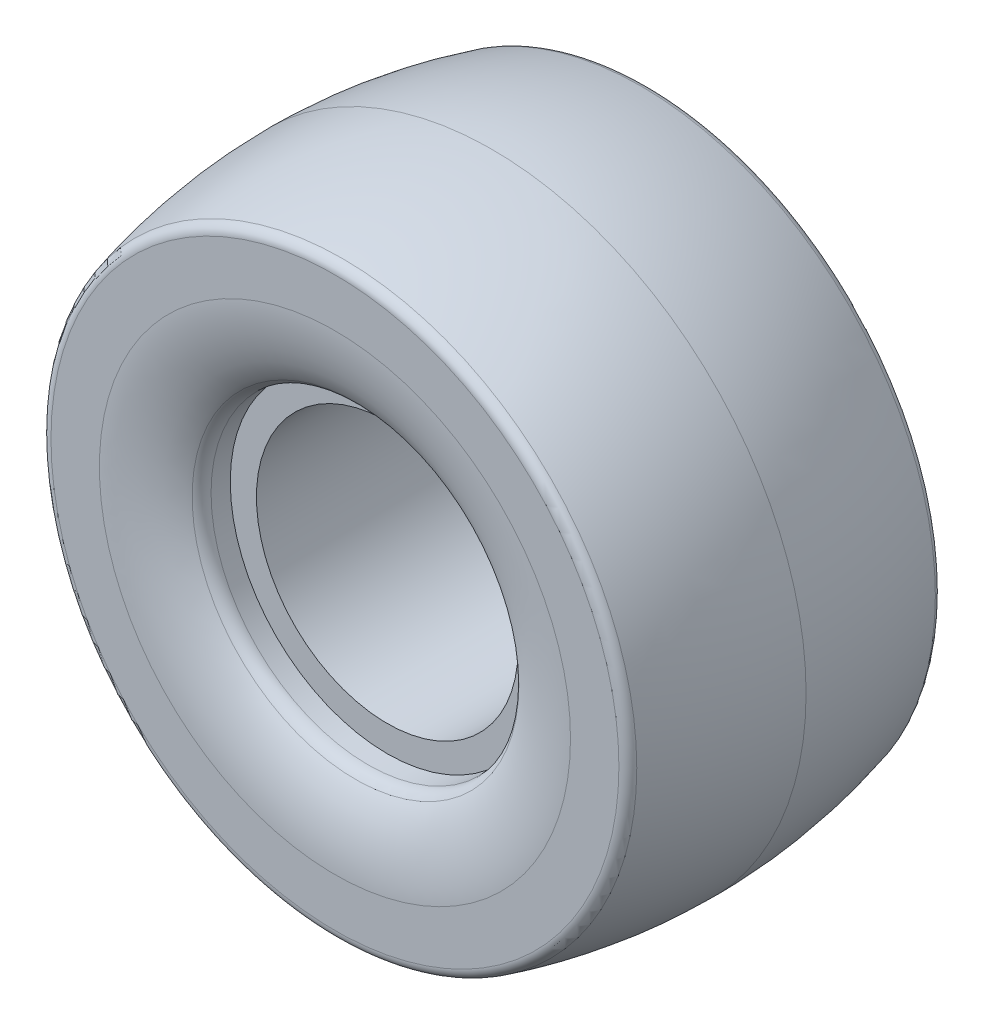
ISO-10303-21;
HEADER;
FILE_DESCRIPTION(('STEP AP214'),'2;1');
FILE_NAME('part.step','',(''),(''),'','','');
FILE_SCHEMA(('AUTOMOTIVE_DESIGN { 1 0 10303 214 1 1 1 1 }'));
ENDSEC;
DATA;
#1=APPLICATION_CONTEXT('core data for automotive mechanical design processes');
#2=APPLICATION_PROTOCOL_DEFINITION('international standard','automotive_design',2000,#1);
#3=PRODUCT_CONTEXT('',#1,'mechanical');
#4=PRODUCT('Part','Part','',(#3));
#5=PRODUCT_RELATED_PRODUCT_CATEGORY('part','',(#4));
#6=PRODUCT_DEFINITION_FORMATION('','',#4);
#7=PRODUCT_DEFINITION_CONTEXT('part definition',#1,'design');
#8=PRODUCT_DEFINITION('design','',#6,#7);
#9=PRODUCT_DEFINITION_SHAPE('','',#8);
#10=(LENGTH_UNIT() NAMED_UNIT(*) SI_UNIT(.MILLI.,.METRE.));
#11=(NAMED_UNIT(*) PLANE_ANGLE_UNIT() SI_UNIT($,.RADIAN.));
#12=(NAMED_UNIT(*) SI_UNIT($,.STERADIAN.) SOLID_ANGLE_UNIT());
#13=UNCERTAINTY_MEASURE_WITH_UNIT(LENGTH_MEASURE(1.E-05),#10,'distance_accuracy_value','');
#14=(GEOMETRIC_REPRESENTATION_CONTEXT(3) GLOBAL_UNCERTAINTY_ASSIGNED_CONTEXT((#13)) GLOBAL_UNIT_ASSIGNED_CONTEXT((#10,
#11,#12)) REPRESENTATION_CONTEXT('',''));
#15=CARTESIAN_POINT('',(0.,0.,0.));
#16=DIRECTION('',(0.,0.,1.));
#17=DIRECTION('',(1.,0.,0.));
#18=AXIS2_PLACEMENT_3D('',#15,#16,#17);
#19=CARTESIAN_POINT('',(0.,25.,20.));
#20=DIRECTION('',(0.,0.,-1.));
#21=DIRECTION('',(-1.,0.,0.));
#22=AXIS2_PLACEMENT_3D('',#19,#20,#21);
#23=PLANE('',#22);
#24=CARTESIAN_POINT('',(0.,0.,20.));
#25=DIRECTION('',(0.,0.,1.));
#26=DIRECTION('',(1.,0.,0.));
#27=AXIS2_PLACEMENT_3D('',#24,#25,#26);
#28=CIRCLE('',#27,25.);
#29=CARTESIAN_POINT('',(25.,0.,20.));
#30=VERTEX_POINT('',#29);
#31=EDGE_CURVE('E81',#30,#30,#28,.T.);
#32=ORIENTED_EDGE('',*,*,#31,.F.);
#33=EDGE_LOOP('',(#32));
#34=FACE_BOUND('',#33,.T.);
#35=CARTESIAN_POINT('',(0.,0.,20.));
#36=DIRECTION('',(0.,0.,1.));
#37=DIRECTION('',(1.,0.,0.));
#38=AXIS2_PLACEMENT_3D('',#35,#36,#37);
#39=CIRCLE('',#38,30.);
#40=CARTESIAN_POINT('',(30.,0.,20.));
#41=VERTEX_POINT('',#40);
#42=EDGE_CURVE('E10',#41,#41,#39,.T.);
#43=ORIENTED_EDGE('',*,*,#42,.T.);
#44=EDGE_LOOP('',(#43));
#45=FACE_BOUND('',#44,.T.);
#46=ADVANCED_FACE('F32',(#34,#45),#23,.F.);
#47=CARTESIAN_POINT('',(0.,0.,30.));
#48=DIRECTION('',(0.,0.,1.));
#49=DIRECTION('',(1.,0.,0.));
#50=AXIS2_PLACEMENT_3D('',#47,#48,#49);
#51=CYLINDRICAL_SURFACE('',#50,30.);
#52=ORIENTED_EDGE('',*,*,#42,.F.);
#53=EDGE_LOOP('',(#52));
#54=FACE_BOUND('',#53,.T.);
#55=CARTESIAN_POINT('',(0.,0.,23.668508033315));
#56=DIRECTION('',(0.,0.,1.));
#57=DIRECTION('',(1.,0.,0.));
#58=AXIS2_PLACEMENT_3D('',#55,#56,#57);
#59=CIRCLE('',#58,30.);
#60=CARTESIAN_POINT('',(30.,0.,23.668508033315));
#61=VERTEX_POINT('',#60);
#62=EDGE_CURVE('E38',#61,#61,#59,.T.);
#63=ORIENTED_EDGE('',*,*,#62,.T.);
#64=EDGE_LOOP('',(#63));
#65=FACE_BOUND('',#64,.T.);
#66=ADVANCED_FACE('F105',(#54,#65),#51,.F.);
#67=CARTESIAN_POINT('',(0.,0.,23.668508033315));
#68=DIRECTION('',(0.,0.,1.));
#69=DIRECTION('',(1.,0.,0.));
#70=AXIS2_PLACEMENT_3D('',#67,#68,#69);
#71=TOROIDAL_SURFACE('',#70,33.,3.00000000000001);
#72=ORIENTED_EDGE('',*,*,#62,.F.);
#73=EDGE_LOOP('',(#72));
#74=FACE_BOUND('',#73,.T.);
#75=CARTESIAN_POINT('',(0.,0.,26.074101645712));
#76=DIRECTION('',(0.,0.,1.));
#77=DIRECTION('',(1.,0.,0.));
#78=AXIS2_PLACEMENT_3D('',#75,#76,#77);
#79=CIRCLE('',#78,31.2074823928355);
#80=CARTESIAN_POINT('',(31.2074823928355,0.,26.074101645712));
#81=VERTEX_POINT('',#80);
#82=EDGE_CURVE('E42',#81,#81,#79,.T.);
#83=ORIENTED_EDGE('',*,*,#82,.T.);
#84=EDGE_LOOP('',(#83));
#85=FACE_BOUND('',#84,.T.);
#86=ADVANCED_FACE('F101',(#74,#85),#71,.T.);
#87=CARTESIAN_POINT('',(0.,45.,30.));
#88=CARTESIAN_POINT('',(0.,42.6861559304344,30.));
#89=CARTESIAN_POINT('',(0.,37.4315997394432,29.2603583772244));
#90=CARTESIAN_POINT('',(0.,32.8491850054114,27.297409200074));
#91=CARTESIAN_POINT('',(0.,31.2074823928355,26.074101645712));
#92=B_SPLINE_CURVE_WITH_KNOTS('',3,(#87,#88,#89,#90,#91),.UNSPECIFIED.,.F.,.F.,(4,1,4),(0.,
0.439021044618023,0.878042089236046),.UNSPECIFIED.);
#93=CARTESIAN_POINT('',(0.,0.,30.));
#94=DIRECTION('',(0.,0.,1.));
#95=AXIS1_PLACEMENT('',#93,#94);
#96=SURFACE_OF_REVOLUTION('',#92,#95);
#97=ORIENTED_EDGE('',*,*,#82,.F.);
#98=EDGE_LOOP('',(#97));
#99=FACE_BOUND('',#98,.T.);
#100=CARTESIAN_POINT('',(0.,0.,30.));
#101=DIRECTION('',(0.,0.,1.));
#102=DIRECTION('',(1.,0.,0.));
#103=AXIS2_PLACEMENT_3D('',#100,#101,#102);
#104=CIRCLE('',#103,45.);
#105=CARTESIAN_POINT('',(45.,0.,30.));
#106=VERTEX_POINT('',#105);
#107=EDGE_CURVE('E46',#106,#106,#104,.T.);
#108=ORIENTED_EDGE('',*,*,#107,.T.);
#109=EDGE_LOOP('',(#108));
#110=FACE_BOUND('',#109,.T.);
#111=ADVANCED_FACE('F96',(#99,#110),#96,.T.);
#112=CARTESIAN_POINT('',(0.,54.2456211986775,30.));
#113=DIRECTION('',(0.,0.,-1.));
#114=DIRECTION('',(-1.,0.,0.));
#115=AXIS2_PLACEMENT_3D('',#112,#113,#114);
#116=PLANE('',#115);
#117=ORIENTED_EDGE('',*,*,#107,.F.);
#118=EDGE_LOOP('',(#117));
#119=FACE_BOUND('',#118,.T.);
#120=CARTESIAN_POINT('',(0.,0.,30.));
#121=DIRECTION('',(0.,0.,1.));
#122=DIRECTION('',(1.,0.,0.));
#123=AXIS2_PLACEMENT_3D('',#120,#121,#122);
#124=CIRCLE('',#123,54.2456211986775);
#125=CARTESIAN_POINT('',(54.2456211986775,0.,30.));
#126=VERTEX_POINT('',#125);
#127=EDGE_CURVE('E51',#126,#126,#124,.T.);
#128=ORIENTED_EDGE('',*,*,#127,.T.);
#129=EDGE_LOOP('',(#128));
#130=FACE_BOUND('',#129,.T.);
#131=ADVANCED_FACE('F100',(#119,#130),#116,.F.);
#132=CARTESIAN_POINT('',(0.,0.,28.));
#133=DIRECTION('',(0.,0.,1.));
#134=DIRECTION('',(1.,0.,0.));
#135=AXIS2_PLACEMENT_3D('',#132,#133,#134);
#136=TOROIDAL_SURFACE('',#135,54.2456211986775,2.);
#137=ORIENTED_EDGE('',*,*,#127,.F.);
#138=EDGE_LOOP('',(#137));
#139=FACE_BOUND('',#138,.T.);
#140=CARTESIAN_POINT('',(0.,0.,28.51788086221));
#141=DIRECTION('',(0.,0.,1.));
#142=DIRECTION('',(1.,0.,0.));
#143=AXIS2_PLACEMENT_3D('',#140,#141,#142);
#144=CIRCLE('',#143,56.1774077843428);
#145=CARTESIAN_POINT('',(56.1774077843428,0.,28.51788086221));
#146=VERTEX_POINT('',#145);
#147=EDGE_CURVE('E54',#146,#146,#144,.T.);
#148=ORIENTED_EDGE('',*,*,#147,.T.);
#149=EDGE_LOOP('',(#148));
#150=FACE_BOUND('',#149,.T.);
#151=ADVANCED_FACE('F164',(#139,#150),#136,.T.);
#152=CARTESIAN_POINT('',(0.,60.,0.));
#153=CARTESIAN_POINT('',(0.,59.9999999999986,4.75298014370305));
#154=CARTESIAN_POINT('',(0.,59.3629012973828,14.2589404311289));
#155=CARTESIAN_POINT('',(0.,57.4516051895622,23.764900718499));
#156=CARTESIAN_POINT('',(0.,56.1774077843428,28.51788086221));
#157=B_SPLINE_CURVE_WITH_KNOTS('',3,(#152,#153,#154,#155,#156),.UNSPECIFIED.,.F.,.F.,(4,1,4),
(0.0247019856292679,0.262350992814421,0.499999999999573),.UNSPECIFIED.);
#158=CARTESIAN_POINT('',(0.,0.,30.));
#159=DIRECTION('',(0.,0.,1.));
#160=AXIS1_PLACEMENT('',#158,#159);
#161=SURFACE_OF_REVOLUTION('',#157,#160);
#162=ORIENTED_EDGE('',*,*,#147,.F.);
#163=EDGE_LOOP('',(#162));
#164=FACE_BOUND('',#163,.T.);
#165=CARTESIAN_POINT('',(0.,0.,0.));
#166=DIRECTION('',(0.,0.,1.));
#167=DIRECTION('',(1.,0.,0.));
#168=AXIS2_PLACEMENT_3D('',#165,#166,#167);
#169=CIRCLE('',#168,60.);
#170=CARTESIAN_POINT('',(60.,0.,0.));
#171=VERTEX_POINT('',#170);
#172=EDGE_CURVE('E57',#171,#171,#169,.T.);
#173=ORIENTED_EDGE('',*,*,#172,.T.);
#174=EDGE_LOOP('',(#173));
#175=FACE_BOUND('',#174,.T.);
#176=ADVANCED_FACE('F161',(#164,#175),#161,.T.);
#177=CARTESIAN_POINT('',(0.,56.1774077843429,-28.51788086221));
#178=CARTESIAN_POINT('',(0.,57.4516051895622,-23.764900718499));
#179=CARTESIAN_POINT('',(0.,59.3629012973828,-14.2589404311289));
#180=CARTESIAN_POINT('',(0.,59.9999999999986,-4.75298014370305));
#181=CARTESIAN_POINT('',(0.,60.,0.));
#182=B_SPLINE_CURVE_WITH_KNOTS('',3,(#177,#178,#179,#180,#181),.UNSPECIFIED.,.F.,.F.,(4,1,4),
(0.0247019856292679,0.262350992814421,0.499999999999573),.UNSPECIFIED.);
#183=CARTESIAN_POINT('',(0.,0.,30.));
#184=DIRECTION('',(0.,0.,1.));
#185=AXIS1_PLACEMENT('',#183,#184);
#186=SURFACE_OF_REVOLUTION('',#182,#185);
#187=ORIENTED_EDGE('',*,*,#172,.F.);
#188=EDGE_LOOP('',(#187));
#189=FACE_BOUND('',#188,.T.);
#190=CARTESIAN_POINT('',(0.,0.,-28.51788086221));
#191=DIRECTION('',(0.,0.,1.));
#192=DIRECTION('',(1.,0.,0.));
#193=AXIS2_PLACEMENT_3D('',#190,#191,#192);
#194=CIRCLE('',#193,56.1774077843429);
#195=CARTESIAN_POINT('',(56.1774077843429,0.,-28.51788086221));
#196=VERTEX_POINT('',#195);
#197=EDGE_CURVE('E60',#196,#196,#194,.T.);
#198=ORIENTED_EDGE('',*,*,#197,.T.);
#199=EDGE_LOOP('',(#198));
#200=FACE_BOUND('',#199,.T.);
#201=ADVANCED_FACE('F157',(#189,#200),#186,.T.);
#202=CARTESIAN_POINT('',(0.,0.,-28.));
#203=DIRECTION('',(0.,0.,1.));
#204=DIRECTION('',(1.,0.,0.));
#205=AXIS2_PLACEMENT_3D('',#202,#203,#204);
#206=TOROIDAL_SURFACE('',#205,54.2456211986775,2.);
#207=ORIENTED_EDGE('',*,*,#197,.F.);
#208=EDGE_LOOP('',(#207));
#209=FACE_BOUND('',#208,.T.);
#210=CARTESIAN_POINT('',(0.,0.,-30.));
#211=DIRECTION('',(0.,0.,1.));
#212=DIRECTION('',(1.,0.,0.));
#213=AXIS2_PLACEMENT_3D('',#210,#211,#212);
#214=CIRCLE('',#213,54.2456211986775);
#215=CARTESIAN_POINT('',(54.2456211986775,0.,-30.));
#216=VERTEX_POINT('',#215);
#217=EDGE_CURVE('E63',#216,#216,#214,.T.);
#218=ORIENTED_EDGE('',*,*,#217,.T.);
#219=EDGE_LOOP('',(#218));
#220=FACE_BOUND('',#219,.T.);
#221=ADVANCED_FACE('F160',(#209,#220),#206,.T.);
#222=CARTESIAN_POINT('',(0.,54.2456211986775,-30.));
#223=DIRECTION('',(0.,0.,1.));
#224=DIRECTION('',(1.,0.,0.));
#225=AXIS2_PLACEMENT_3D('',#222,#223,#224);
#226=PLANE('',#225);
#227=ORIENTED_EDGE('',*,*,#217,.F.);
#228=EDGE_LOOP('',(#227));
#229=FACE_BOUND('',#228,.T.);
#230=CARTESIAN_POINT('',(0.,0.,-30.));
#231=DIRECTION('',(0.,0.,1.));
#232=DIRECTION('',(1.,0.,0.));
#233=AXIS2_PLACEMENT_3D('',#230,#231,#232);
#234=CIRCLE('',#233,45.);
#235=CARTESIAN_POINT('',(45.,0.,-30.));
#236=VERTEX_POINT('',#235);
#237=EDGE_CURVE('E66',#236,#236,#234,.T.);
#238=ORIENTED_EDGE('',*,*,#237,.T.);
#239=EDGE_LOOP('',(#238));
#240=FACE_BOUND('',#239,.T.);
#241=ADVANCED_FACE('F141',(#229,#240),#226,.F.);
#242=CARTESIAN_POINT('',(0.,31.2074823928356,-26.074101645712));
#243=CARTESIAN_POINT('',(0.,32.8491850054114,-27.297409200074));
#244=CARTESIAN_POINT('',(0.,37.4315997394432,-29.2603583772244));
#245=CARTESIAN_POINT('',(0.,42.6861559304344,-30.));
#246=CARTESIAN_POINT('',(0.,45.,-30.));
#247=B_SPLINE_CURVE_WITH_KNOTS('',3,(#242,#243,#244,#245,#246),.UNSPECIFIED.,.F.,.F.,(4,1,4),
(0.,0.439021044618023,0.878042089236046),.UNSPECIFIED.);
#248=CARTESIAN_POINT('',(0.,0.,30.));
#249=DIRECTION('',(0.,0.,1.));
#250=AXIS1_PLACEMENT('',#248,#249);
#251=SURFACE_OF_REVOLUTION('',#247,#250);
#252=ORIENTED_EDGE('',*,*,#237,.F.);
#253=EDGE_LOOP('',(#252));
#254=FACE_BOUND('',#253,.T.);
#255=CARTESIAN_POINT('',(0.,0.,-26.0741016457121));
#256=DIRECTION('',(0.,0.,1.));
#257=DIRECTION('',(1.,0.,0.));
#258=AXIS2_PLACEMENT_3D('',#255,#256,#257);
#259=CIRCLE('',#258,31.2074823928355);
#260=CARTESIAN_POINT('',(31.2074823928355,0.,-26.0741016457121));
#261=VERTEX_POINT('',#260);
#262=EDGE_CURVE('E69',#261,#261,#259,.T.);
#263=ORIENTED_EDGE('',*,*,#262,.T.);
#264=EDGE_LOOP('',(#263));
#265=FACE_BOUND('',#264,.T.);
#266=ADVANCED_FACE('F136',(#254,#265),#251,.T.);
#267=CARTESIAN_POINT('',(0.,0.,-23.668508033315));
#268=DIRECTION('',(0.,0.,1.));
#269=DIRECTION('',(1.,0.,0.));
#270=AXIS2_PLACEMENT_3D('',#267,#268,#269);
#271=TOROIDAL_SURFACE('',#270,33.,3.00000000000001);
#272=ORIENTED_EDGE('',*,*,#262,.F.);
#273=EDGE_LOOP('',(#272));
#274=FACE_BOUND('',#273,.T.);
#275=CARTESIAN_POINT('',(0.,0.,-23.668508033315));
#276=DIRECTION('',(0.,0.,1.));
#277=DIRECTION('',(1.,0.,0.));
#278=AXIS2_PLACEMENT_3D('',#275,#276,#277);
#279=CIRCLE('',#278,30.);
#280=CARTESIAN_POINT('',(30.,0.,-23.668508033315));
#281=VERTEX_POINT('',#280);
#282=EDGE_CURVE('E72',#281,#281,#279,.T.);
#283=ORIENTED_EDGE('',*,*,#282,.T.);
#284=EDGE_LOOP('',(#283));
#285=FACE_BOUND('',#284,.T.);
#286=ADVANCED_FACE('F132',(#274,#285),#271,.T.);
#287=CARTESIAN_POINT('',(0.,0.,30.));
#288=DIRECTION('',(0.,0.,1.));
#289=DIRECTION('',(1.,0.,0.));
#290=AXIS2_PLACEMENT_3D('',#287,#288,#289);
#291=CYLINDRICAL_SURFACE('',#290,30.);
#292=ORIENTED_EDGE('',*,*,#282,.F.);
#293=EDGE_LOOP('',(#292));
#294=FACE_BOUND('',#293,.T.);
#295=CARTESIAN_POINT('',(0.,0.,-20.));
#296=DIRECTION('',(0.,0.,1.));
#297=DIRECTION('',(1.,0.,0.));
#298=AXIS2_PLACEMENT_3D('',#295,#296,#297);
#299=CIRCLE('',#298,30.);
#300=CARTESIAN_POINT('',(30.,0.,-20.));
#301=VERTEX_POINT('',#300);
#302=EDGE_CURVE('E75',#301,#301,#299,.T.);
#303=ORIENTED_EDGE('',*,*,#302,.T.);
#304=EDGE_LOOP('',(#303));
#305=FACE_BOUND('',#304,.T.);
#306=ADVANCED_FACE('F125',(#294,#305),#291,.F.);
#307=CARTESIAN_POINT('',(0.,25.,-20.));
#308=DIRECTION('',(0.,0.,1.));
#309=DIRECTION('',(1.,0.,0.));
#310=AXIS2_PLACEMENT_3D('',#307,#308,#309);
#311=PLANE('',#310);
#312=ORIENTED_EDGE('',*,*,#302,.F.);
#313=EDGE_LOOP('',(#312));
#314=FACE_BOUND('',#313,.T.);
#315=CARTESIAN_POINT('',(0.,0.,-20.));
#316=DIRECTION('',(0.,0.,1.));
#317=DIRECTION('',(1.,0.,0.));
#318=AXIS2_PLACEMENT_3D('',#315,#316,#317);
#319=CIRCLE('',#318,25.);
#320=CARTESIAN_POINT('',(25.,0.,-20.));
#321=VERTEX_POINT('',#320);
#322=EDGE_CURVE('E78',#321,#321,#319,.T.);
#323=ORIENTED_EDGE('',*,*,#322,.T.);
#324=EDGE_LOOP('',(#323));
#325=FACE_BOUND('',#324,.T.);
#326=ADVANCED_FACE('F119',(#314,#325),#311,.F.);
#327=CARTESIAN_POINT('',(0.,0.,30.));
#328=DIRECTION('',(0.,0.,1.));
#329=DIRECTION('',(1.,0.,0.));
#330=AXIS2_PLACEMENT_3D('',#327,#328,#329);
#331=CYLINDRICAL_SURFACE('',#330,25.);
#332=ORIENTED_EDGE('',*,*,#322,.F.);
#333=EDGE_LOOP('',(#332));
#334=FACE_BOUND('',#333,.T.);
#335=ORIENTED_EDGE('',*,*,#31,.T.);
#336=EDGE_LOOP('',(#335));
#337=FACE_BOUND('',#336,.T.);
#338=ADVANCED_FACE('F117',(#334,#337),#331,.F.);
#339=CLOSED_SHELL('',(#46,#66,#86,#111,#131,#151,#176,#201,#221,#241,#266,#286,#306,#326,#338));
#340=MANIFOLD_SOLID_BREP('B2',#339);
#341=ADVANCED_BREP_SHAPE_REPRESENTATION('',(#18,#340),#14);
#342=SHAPE_DEFINITION_REPRESENTATION(#9,#341);
ENDSEC;
END-ISO-10303-21;
